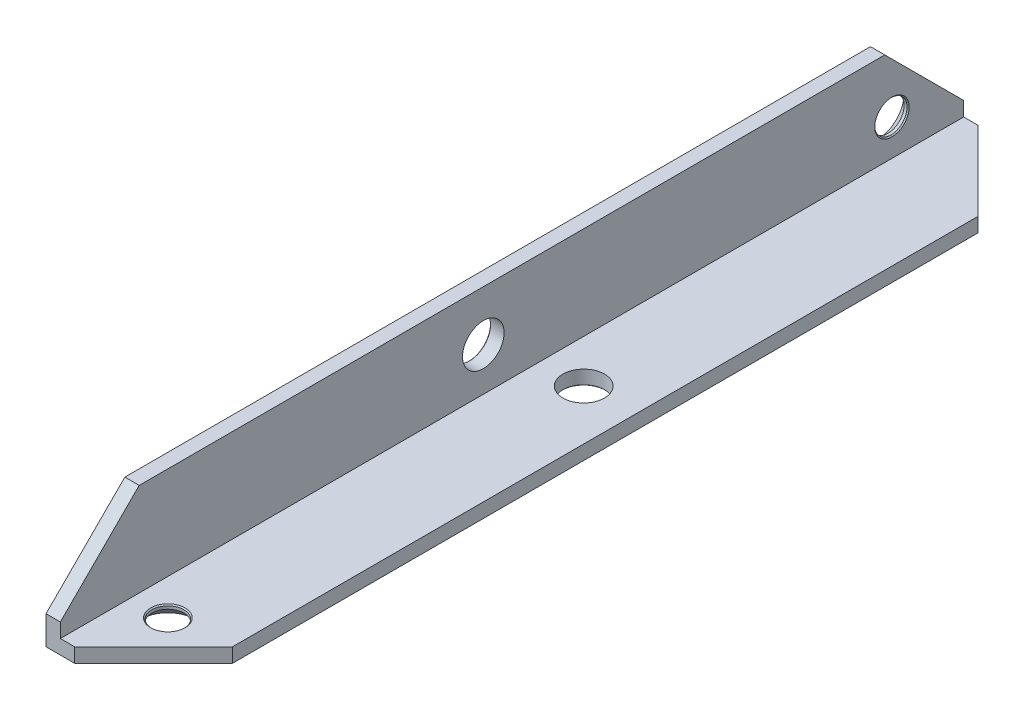
ISO-10303-21;
HEADER;
FILE_DESCRIPTION(('STEP AP214'),'2;1');
FILE_NAME('part.step','',(''),(''),'','','');
FILE_SCHEMA(('AUTOMOTIVE_DESIGN { 1 0 10303 214 1 1 1 1 }'));
ENDSEC;
DATA;
#1=APPLICATION_CONTEXT('core data for automotive mechanical design processes');
#2=APPLICATION_PROTOCOL_DEFINITION('international standard','automotive_design',2000,#1);
#3=PRODUCT_CONTEXT('',#1,'mechanical');
#4=PRODUCT('Part','Part','',(#3));
#5=PRODUCT_RELATED_PRODUCT_CATEGORY('part','',(#4));
#6=PRODUCT_DEFINITION_FORMATION('','',#4);
#7=PRODUCT_DEFINITION_CONTEXT('part definition',#1,'design');
#8=PRODUCT_DEFINITION('design','',#6,#7);
#9=PRODUCT_DEFINITION_SHAPE('','',#8);
#10=(LENGTH_UNIT() NAMED_UNIT(*) SI_UNIT(.MILLI.,.METRE.));
#11=(NAMED_UNIT(*) PLANE_ANGLE_UNIT() SI_UNIT($,.RADIAN.));
#12=(NAMED_UNIT(*) SI_UNIT($,.STERADIAN.) SOLID_ANGLE_UNIT());
#13=UNCERTAINTY_MEASURE_WITH_UNIT(LENGTH_MEASURE(1.E-05),#10,'distance_accuracy_value','');
#14=(GEOMETRIC_REPRESENTATION_CONTEXT(3) GLOBAL_UNCERTAINTY_ASSIGNED_CONTEXT((#13)) GLOBAL_UNIT_ASSIGNED_CONTEXT((#10,
#11,#12)) REPRESENTATION_CONTEXT('',''));
#15=CARTESIAN_POINT('',(0.,0.,0.));
#16=DIRECTION('',(0.,0.,1.));
#17=DIRECTION('',(1.,0.,0.));
#18=AXIS2_PLACEMENT_3D('',#15,#16,#17);
#19=CARTESIAN_POINT('',(15.,0.,126.));
#20=DIRECTION('',(0.,1.,0.));
#21=DIRECTION('',(-1.,0.,0.));
#22=AXIS2_PLACEMENT_3D('',#19,#20,#21);
#23=PLANE('',#22);
#24=CARTESIAN_POINT('',(8.,0.,59.));
#25=DIRECTION('',(0.,-1.,0.));
#26=DIRECTION('',(0.,0.,-1.));
#27=AXIS2_PLACEMENT_3D('',#24,#25,#26);
#28=CIRCLE('',#27,3.);
#29=CARTESIAN_POINT('',(8.,0.,56.));
#30=VERTEX_POINT('',#29);
#31=EDGE_CURVE('E201',#30,#30,#28,.T.);
#32=ORIENTED_EDGE('',*,*,#31,.F.);
#33=EDGE_LOOP('',(#32));
#34=FACE_BOUND('',#33,.T.);
#35=CARTESIAN_POINT('',(7.,0.,116.));
#36=DIRECTION('',(0.,-1.,0.));
#37=DIRECTION('',(0.,0.,-1.));
#38=AXIS2_PLACEMENT_3D('',#35,#36,#37);
#39=CIRCLE('',#38,3.7);
#40=CARTESIAN_POINT('',(7.,0.,112.3));
#41=VERTEX_POINT('',#40);
#42=EDGE_CURVE('E220',#41,#41,#39,.T.);
#43=ORIENTED_EDGE('',*,*,#42,.F.);
#44=EDGE_LOOP('',(#43));
#45=FACE_BOUND('',#44,.T.);
#46=DIRECTION('',(1.,0.,0.));
#47=VECTOR('',#46,1.);
#48=CARTESIAN_POINT('',(15.,0.,0.));
#49=LINE('',#48,#47);
#50=CARTESIAN_POINT('',(0.,0.,0.));
#51=VERTEX_POINT('',#50);
#52=CARTESIAN_POINT('',(3.99999999999996,0.,0.));
#53=VERTEX_POINT('',#52);
#54=EDGE_CURVE('E144',#51,#53,#49,.T.);
#55=ORIENTED_EDGE('',*,*,#54,.T.);
#56=DIRECTION('',(0.707106781186549,0.,0.707106781186546));
#57=VECTOR('',#56,1.);
#58=CARTESIAN_POINT('',(15.,0.,11.));
#59=LINE('',#58,#57);
#60=CARTESIAN_POINT('',(15.,0.,11.));
#61=VERTEX_POINT('',#60);
#62=EDGE_CURVE('E189',#53,#61,#59,.T.);
#63=ORIENTED_EDGE('',*,*,#62,.T.);
#64=DIRECTION('',(0.,0.,-1.));
#65=VECTOR('',#64,1.);
#66=CARTESIAN_POINT('',(15.,0.,126.));
#67=LINE('',#66,#65);
#68=CARTESIAN_POINT('',(15.,0.,115.));
#69=VERTEX_POINT('',#68);
#70=EDGE_CURVE('E161',#69,#61,#67,.T.);
#71=ORIENTED_EDGE('',*,*,#70,.F.);
#72=DIRECTION('',(0.707106781186546,0.,-0.707106781186549));
#73=VECTOR('',#72,1.);
#74=CARTESIAN_POINT('',(4.,0.,126.));
#75=LINE('',#74,#73);
#76=CARTESIAN_POINT('',(4.,0.,126.));
#77=VERTEX_POINT('',#76);
#78=EDGE_CURVE('E48',#69,#77,#75,.F.);
#79=ORIENTED_EDGE('',*,*,#78,.T.);
#80=DIRECTION('',(1.,0.,0.));
#81=VECTOR('',#80,1.);
#82=CARTESIAN_POINT('',(15.,0.,126.));
#83=LINE('',#82,#81);
#84=CARTESIAN_POINT('',(0.,0.,126.));
#85=VERTEX_POINT('',#84);
#86=EDGE_CURVE('E120',#85,#77,#83,.T.);
#87=ORIENTED_EDGE('',*,*,#86,.F.);
#88=DIRECTION('',(0.,0.,-1.));
#89=VECTOR('',#88,1.);
#90=CARTESIAN_POINT('',(0.,0.,126.));
#91=LINE('',#90,#89);
#92=EDGE_CURVE('E140',#85,#51,#91,.T.);
#93=ORIENTED_EDGE('',*,*,#92,.T.);
#94=EDGE_LOOP('',(#55,#63,#71,#79,#87,#93));
#95=FACE_BOUND('',#94,.T.);
#96=ADVANCED_FACE('F31',(#34,#45,#95),#23,.F.);
#97=CARTESIAN_POINT('',(15.,2.,126.));
#98=DIRECTION('',(-1.,0.,0.));
#99=DIRECTION('',(0.,-1.,0.));
#100=AXIS2_PLACEMENT_3D('',#97,#98,#99);
#101=PLANE('',#100);
#102=ORIENTED_EDGE('',*,*,#70,.T.);
#103=DIRECTION('',(0.,1.,0.));
#104=VECTOR('',#103,1.);
#105=CARTESIAN_POINT('',(15.,2.,11.));
#106=LINE('',#105,#104);
#107=CARTESIAN_POINT('',(15.,2.,11.));
#108=VERTEX_POINT('',#107);
#109=EDGE_CURVE('E182',#61,#108,#106,.T.);
#110=ORIENTED_EDGE('',*,*,#109,.T.);
#111=DIRECTION('',(0.,0.,-1.));
#112=VECTOR('',#111,1.);
#113=CARTESIAN_POINT('',(15.,2.,126.));
#114=LINE('',#113,#112);
#115=CARTESIAN_POINT('',(15.,2.,115.));
#116=VERTEX_POINT('',#115);
#117=EDGE_CURVE('E131',#116,#108,#114,.T.);
#118=ORIENTED_EDGE('',*,*,#117,.F.);
#119=DIRECTION('',(0.,-1.,0.));
#120=VECTOR('',#119,1.);
#121=CARTESIAN_POINT('',(15.,2.,115.));
#122=LINE('',#121,#120);
#123=EDGE_CURVE('E180',#116,#69,#122,.T.);
#124=ORIENTED_EDGE('',*,*,#123,.T.);
#125=EDGE_LOOP('',(#102,#110,#118,#124));
#126=FACE_BOUND('',#125,.T.);
#127=ADVANCED_FACE('F232',(#126),#101,.F.);
#128=CARTESIAN_POINT('',(2.,2.,126.));
#129=DIRECTION('',(0.,-1.,0.));
#130=DIRECTION('',(0.,0.,-1.));
#131=AXIS2_PLACEMENT_3D('',#128,#129,#130);
#132=PLANE('',#131);
#133=CARTESIAN_POINT('',(8.,2.,59.));
#134=DIRECTION('',(0.,-1.,0.));
#135=DIRECTION('',(0.,0.,-1.));
#136=AXIS2_PLACEMENT_3D('',#133,#134,#135);
#137=CIRCLE('',#136,2.89999999999999);
#138=CARTESIAN_POINT('',(8.,2.,56.1));
#139=VERTEX_POINT('',#138);
#140=EDGE_CURVE('E191',#139,#139,#137,.T.);
#141=ORIENTED_EDGE('',*,*,#140,.T.);
#142=EDGE_LOOP('',(#141));
#143=FACE_BOUND('',#142,.T.);
#144=CARTESIAN_POINT('',(7.,2.,116.));
#145=DIRECTION('',(0.,-1.,0.));
#146=DIRECTION('',(0.,0.,-1.));
#147=AXIS2_PLACEMENT_3D('',#144,#145,#146);
#148=CIRCLE('',#147,2.4);
#149=CARTESIAN_POINT('',(7.,2.,113.6));
#150=VERTEX_POINT('',#149);
#151=EDGE_CURVE('E217',#150,#150,#148,.T.);
#152=ORIENTED_EDGE('',*,*,#151,.T.);
#153=EDGE_LOOP('',(#152));
#154=FACE_BOUND('',#153,.T.);
#155=ORIENTED_EDGE('',*,*,#117,.T.);
#156=DIRECTION('',(-0.707106781186549,0.,-0.707106781186546));
#157=VECTOR('',#156,1.);
#158=CARTESIAN_POINT('',(15.,2.,11.));
#159=LINE('',#158,#157);
#160=CARTESIAN_POINT('',(3.99999999999996,2.,0.));
#161=VERTEX_POINT('',#160);
#162=EDGE_CURVE('E186',#108,#161,#159,.T.);
#163=ORIENTED_EDGE('',*,*,#162,.T.);
#164=DIRECTION('',(-1.,0.,0.));
#165=VECTOR('',#164,1.);
#166=CARTESIAN_POINT('',(2.,2.,0.));
#167=LINE('',#166,#165);
#168=CARTESIAN_POINT('',(2.,2.,0.));
#169=VERTEX_POINT('',#168);
#170=EDGE_CURVE('E127',#161,#169,#167,.T.);
#171=ORIENTED_EDGE('',*,*,#170,.T.);
#172=DIRECTION('',(0.,0.,-1.));
#173=VECTOR('',#172,1.);
#174=CARTESIAN_POINT('',(2.,2.,126.));
#175=LINE('',#174,#173);
#176=CARTESIAN_POINT('',(2.,2.,126.));
#177=VERTEX_POINT('',#176);
#178=EDGE_CURVE('E123',#177,#169,#175,.T.);
#179=ORIENTED_EDGE('',*,*,#178,.F.);
#180=DIRECTION('',(-1.,0.,0.));
#181=VECTOR('',#180,1.);
#182=CARTESIAN_POINT('',(2.,2.,126.));
#183=LINE('',#182,#181);
#184=CARTESIAN_POINT('',(4.,2.,126.));
#185=VERTEX_POINT('',#184);
#186=EDGE_CURVE('E112',#185,#177,#183,.T.);
#187=ORIENTED_EDGE('',*,*,#186,.F.);
#188=DIRECTION('',(-0.707106781186546,0.,0.707106781186549));
#189=VECTOR('',#188,1.);
#190=CARTESIAN_POINT('',(4.,2.,126.));
#191=LINE('',#190,#189);
#192=EDGE_CURVE('E56',#185,#116,#191,.F.);
#193=ORIENTED_EDGE('',*,*,#192,.T.);
#194=EDGE_LOOP('',(#155,#163,#171,#179,#187,#193));
#195=FACE_BOUND('',#194,.T.);
#196=ADVANCED_FACE('F125',(#143,#154,#195),#132,.F.);
#197=CARTESIAN_POINT('',(2.,15.,126.));
#198=DIRECTION('',(-1.,0.,0.));
#199=DIRECTION('',(0.,-1.,0.));
#200=AXIS2_PLACEMENT_3D('',#197,#198,#199);
#201=PLANE('',#200);
#202=CARTESIAN_POINT('',(2.,8.,67.));
#203=DIRECTION('',(-1.,0.,0.));
#204=DIRECTION('',(0.,-1.,0.));
#205=AXIS2_PLACEMENT_3D('',#202,#203,#204);
#206=CIRCLE('',#205,2.89999999999999);
#207=CARTESIAN_POINT('',(2.,5.10000000000001,67.));
#208=VERTEX_POINT('',#207);
#209=EDGE_CURVE('E35',#208,#208,#206,.T.);
#210=ORIENTED_EDGE('',*,*,#209,.T.);
#211=EDGE_LOOP('',(#210));
#212=FACE_BOUND('',#211,.T.);
#213=CARTESIAN_POINT('',(2.,7.,9.99999999999999));
#214=DIRECTION('',(-1.,0.,0.));
#215=DIRECTION('',(0.,0.,1.));
#216=AXIS2_PLACEMENT_3D('',#213,#214,#215);
#217=CIRCLE('',#216,2.4);
#218=CARTESIAN_POINT('',(2.,7.,12.4));
#219=VERTEX_POINT('',#218);
#220=EDGE_CURVE('E193',#219,#219,#217,.T.);
#221=ORIENTED_EDGE('',*,*,#220,.T.);
#222=EDGE_LOOP('',(#221));
#223=FACE_BOUND('',#222,.T.);
#224=DIRECTION('',(0.,1.,0.));
#225=VECTOR('',#224,1.);
#226=CARTESIAN_POINT('',(2.,15.,0.));
#227=LINE('',#226,#225);
#228=CARTESIAN_POINT('',(2.,3.99999999999996,0.));
#229=VERTEX_POINT('',#228);
#230=EDGE_CURVE('E149',#169,#229,#227,.T.);
#231=ORIENTED_EDGE('',*,*,#230,.T.);
#232=DIRECTION('',(0.,0.707106781186549,0.707106781186546));
#233=VECTOR('',#232,1.);
#234=CARTESIAN_POINT('',(2.,15.,11.));
#235=LINE('',#234,#233);
#236=CARTESIAN_POINT('',(2.,15.,11.));
#237=VERTEX_POINT('',#236);
#238=EDGE_CURVE('E178',#229,#237,#235,.T.);
#239=ORIENTED_EDGE('',*,*,#238,.T.);
#240=DIRECTION('',(0.,0.,-1.));
#241=VECTOR('',#240,1.);
#242=CARTESIAN_POINT('',(2.,15.,126.));
#243=LINE('',#242,#241);
#244=CARTESIAN_POINT('',(2.,15.,115.));
#245=VERTEX_POINT('',#244);
#246=EDGE_CURVE('E132',#245,#237,#243,.T.);
#247=ORIENTED_EDGE('',*,*,#246,.F.);
#248=DIRECTION('',(0.,0.707106781186546,-0.707106781186549));
#249=VECTOR('',#248,1.);
#250=CARTESIAN_POINT('',(2.,4.,126.));
#251=LINE('',#250,#249);
#252=CARTESIAN_POINT('',(2.,4.,126.));
#253=VERTEX_POINT('',#252);
#254=EDGE_CURVE('E137',#245,#253,#251,.F.);
#255=ORIENTED_EDGE('',*,*,#254,.T.);
#256=DIRECTION('',(0.,1.,0.));
#257=VECTOR('',#256,1.);
#258=CARTESIAN_POINT('',(2.,15.,126.));
#259=LINE('',#258,#257);
#260=EDGE_CURVE('E117',#177,#253,#259,.T.);
#261=ORIENTED_EDGE('',*,*,#260,.F.);
#262=ORIENTED_EDGE('',*,*,#178,.T.);
#263=EDGE_LOOP('',(#231,#239,#247,#255,#261,#262));
#264=FACE_BOUND('',#263,.T.);
#265=ADVANCED_FACE('F134',(#212,#223,#264),#201,.F.);
#266=CARTESIAN_POINT('',(0.,15.,126.));
#267=DIRECTION('',(0.,-1.,0.));
#268=DIRECTION('',(1.,0.,0.));
#269=AXIS2_PLACEMENT_3D('',#266,#267,#268);
#270=PLANE('',#269);
#271=ORIENTED_EDGE('',*,*,#246,.T.);
#272=DIRECTION('',(-1.,0.,0.));
#273=VECTOR('',#272,1.);
#274=CARTESIAN_POINT('',(0.,15.,11.));
#275=LINE('',#274,#273);
#276=CARTESIAN_POINT('',(0.,15.,11.));
#277=VERTEX_POINT('',#276);
#278=EDGE_CURVE('E166',#237,#277,#275,.T.);
#279=ORIENTED_EDGE('',*,*,#278,.T.);
#280=DIRECTION('',(0.,0.,-1.));
#281=VECTOR('',#280,1.);
#282=CARTESIAN_POINT('',(0.,15.,126.));
#283=LINE('',#282,#281);
#284=CARTESIAN_POINT('',(0.,15.,115.));
#285=VERTEX_POINT('',#284);
#286=EDGE_CURVE('E155',#285,#277,#283,.T.);
#287=ORIENTED_EDGE('',*,*,#286,.F.);
#288=DIRECTION('',(1.,0.,0.));
#289=VECTOR('',#288,1.);
#290=CARTESIAN_POINT('',(0.,15.,115.));
#291=LINE('',#290,#289);
#292=EDGE_CURVE('E164',#285,#245,#291,.T.);
#293=ORIENTED_EDGE('',*,*,#292,.T.);
#294=EDGE_LOOP('',(#271,#279,#287,#293));
#295=FACE_BOUND('',#294,.T.);
#296=ADVANCED_FACE('F249',(#295),#270,.F.);
#297=CARTESIAN_POINT('',(0.,0.,126.));
#298=DIRECTION('',(1.,0.,0.));
#299=DIRECTION('',(0.,0.,-1.));
#300=AXIS2_PLACEMENT_3D('',#297,#298,#299);
#301=PLANE('',#300);
#302=CARTESIAN_POINT('',(0.,8.,67.));
#303=DIRECTION('',(-1.,0.,0.));
#304=DIRECTION('',(0.,0.,1.));
#305=AXIS2_PLACEMENT_3D('',#302,#303,#304);
#306=CIRCLE('',#305,3.);
#307=CARTESIAN_POINT('',(0.,8.,70.));
#308=VERTEX_POINT('',#307);
#309=EDGE_CURVE('E458',#308,#308,#306,.T.);
#310=ORIENTED_EDGE('',*,*,#309,.F.);
#311=EDGE_LOOP('',(#310));
#312=FACE_BOUND('',#311,.T.);
#313=CARTESIAN_POINT('',(0.,7.,9.99999999999999));
#314=DIRECTION('',(-1.,0.,0.));
#315=DIRECTION('',(0.,0.,1.));
#316=AXIS2_PLACEMENT_3D('',#313,#314,#315);
#317=CIRCLE('',#316,3.7);
#318=CARTESIAN_POINT('',(0.,7.,13.7));
#319=VERTEX_POINT('',#318);
#320=EDGE_CURVE('E198',#319,#319,#317,.T.);
#321=ORIENTED_EDGE('',*,*,#320,.F.);
#322=EDGE_LOOP('',(#321));
#323=FACE_BOUND('',#322,.T.);
#324=ORIENTED_EDGE('',*,*,#286,.T.);
#325=DIRECTION('',(0.,-0.707106781186549,-0.707106781186546));
#326=VECTOR('',#325,1.);
#327=CARTESIAN_POINT('',(0.,15.,11.));
#328=LINE('',#327,#326);
#329=CARTESIAN_POINT('',(0.,3.99999999999996,0.));
#330=VERTEX_POINT('',#329);
#331=EDGE_CURVE('E171',#277,#330,#328,.T.);
#332=ORIENTED_EDGE('',*,*,#331,.T.);
#333=DIRECTION('',(0.,-1.,0.));
#334=VECTOR('',#333,1.);
#335=CARTESIAN_POINT('',(0.,0.,0.));
#336=LINE('',#335,#334);
#337=EDGE_CURVE('E151',#330,#51,#336,.T.);
#338=ORIENTED_EDGE('',*,*,#337,.T.);
#339=ORIENTED_EDGE('',*,*,#92,.F.);
#340=DIRECTION('',(0.,-1.,0.));
#341=VECTOR('',#340,1.);
#342=CARTESIAN_POINT('',(0.,0.,126.));
#343=LINE('',#342,#341);
#344=CARTESIAN_POINT('',(0.,4.,126.));
#345=VERTEX_POINT('',#344);
#346=EDGE_CURVE('E138',#345,#85,#343,.T.);
#347=ORIENTED_EDGE('',*,*,#346,.F.);
#348=DIRECTION('',(0.,-0.707106781186546,0.707106781186549));
#349=VECTOR('',#348,1.);
#350=CARTESIAN_POINT('',(0.,4.,126.));
#351=LINE('',#350,#349);
#352=EDGE_CURVE('E169',#345,#285,#351,.F.);
#353=ORIENTED_EDGE('',*,*,#352,.T.);
#354=EDGE_LOOP('',(#324,#332,#338,#339,#347,#353));
#355=FACE_BOUND('',#354,.T.);
#356=ADVANCED_FACE('F252',(#312,#323,#355),#301,.F.);
#357=CARTESIAN_POINT('',(0.,0.,126.));
#358=DIRECTION('',(0.,0.,-1.));
#359=DIRECTION('',(-1.,0.,0.));
#360=AXIS2_PLACEMENT_3D('',#357,#358,#359);
#361=PLANE('',#360);
#362=ORIENTED_EDGE('',*,*,#86,.T.);
#363=DIRECTION('',(0.,1.,0.));
#364=VECTOR('',#363,1.);
#365=CARTESIAN_POINT('',(4.,0.,126.));
#366=LINE('',#365,#364);
#367=EDGE_CURVE('E11',#77,#185,#366,.T.);
#368=ORIENTED_EDGE('',*,*,#367,.T.);
#369=ORIENTED_EDGE('',*,*,#186,.T.);
#370=ORIENTED_EDGE('',*,*,#260,.T.);
#371=DIRECTION('',(-1.,0.,0.));
#372=VECTOR('',#371,1.);
#373=CARTESIAN_POINT('',(0.,4.,126.));
#374=LINE('',#373,#372);
#375=EDGE_CURVE('E40',#253,#345,#374,.T.);
#376=ORIENTED_EDGE('',*,*,#375,.T.);
#377=ORIENTED_EDGE('',*,*,#346,.T.);
#378=EDGE_LOOP('',(#362,#368,#369,#370,#376,#377));
#379=FACE_BOUND('',#378,.T.);
#380=ADVANCED_FACE('F114',(#379),#361,.F.);
#381=CARTESIAN_POINT('',(0.,0.,0.));
#382=DIRECTION('',(0.,0.,-1.));
#383=DIRECTION('',(-1.,0.,0.));
#384=AXIS2_PLACEMENT_3D('',#381,#382,#383);
#385=PLANE('',#384);
#386=ORIENTED_EDGE('',*,*,#337,.F.);
#387=DIRECTION('',(1.,0.,0.));
#388=VECTOR('',#387,1.);
#389=CARTESIAN_POINT('',(2.00000000000001,3.99999999999996,0.));
#390=LINE('',#389,#388);
#391=EDGE_CURVE('E175',#330,#229,#390,.T.);
#392=ORIENTED_EDGE('',*,*,#391,.T.);
#393=ORIENTED_EDGE('',*,*,#230,.F.);
#394=ORIENTED_EDGE('',*,*,#170,.F.);
#395=DIRECTION('',(0.,-1.,0.));
#396=VECTOR('',#395,1.);
#397=CARTESIAN_POINT('',(3.99999999999996,0.,0.));
#398=LINE('',#397,#396);
#399=EDGE_CURVE('E173',#161,#53,#398,.T.);
#400=ORIENTED_EDGE('',*,*,#399,.T.);
#401=ORIENTED_EDGE('',*,*,#54,.F.);
#402=EDGE_LOOP('',(#386,#392,#393,#394,#400,#401));
#403=FACE_BOUND('',#402,.T.);
#404=ADVANCED_FACE('F241',(#403),#385,.T.);
#405=CARTESIAN_POINT('',(0.,15.,11.));
#406=DIRECTION('',(0.,0.707106781186546,-0.707106781186549));
#407=DIRECTION('',(0.,0.707106781186549,0.707106781186546));
#408=AXIS2_PLACEMENT_3D('',#405,#406,#407);
#409=PLANE('',#408);
#410=ORIENTED_EDGE('',*,*,#238,.F.);
#411=ORIENTED_EDGE('',*,*,#391,.F.);
#412=ORIENTED_EDGE('',*,*,#331,.F.);
#413=ORIENTED_EDGE('',*,*,#278,.F.);
#414=EDGE_LOOP('',(#410,#411,#412,#413));
#415=FACE_BOUND('',#414,.T.);
#416=ADVANCED_FACE('F246',(#415),#409,.T.);
#417=CARTESIAN_POINT('',(15.,2.,11.));
#418=DIRECTION('',(0.707106781186546,0.,-0.707106781186549));
#419=DIRECTION('',(-0.707106781186549,0.,-0.707106781186546));
#420=AXIS2_PLACEMENT_3D('',#417,#418,#419);
#421=PLANE('',#420);
#422=ORIENTED_EDGE('',*,*,#62,.F.);
#423=ORIENTED_EDGE('',*,*,#399,.F.);
#424=ORIENTED_EDGE('',*,*,#162,.F.);
#425=ORIENTED_EDGE('',*,*,#109,.F.);
#426=EDGE_LOOP('',(#422,#423,#424,#425));
#427=FACE_BOUND('',#426,.T.);
#428=ADVANCED_FACE('F238',(#427),#421,.T.);
#429=CARTESIAN_POINT('',(4.,0.,126.));
#430=DIRECTION('',(-0.707106781186549,0.,-0.707106781186546));
#431=DIRECTION('',(-0.707106781186546,0.,0.707106781186549));
#432=AXIS2_PLACEMENT_3D('',#429,#430,#431);
#433=PLANE('',#432);
#434=ORIENTED_EDGE('',*,*,#78,.F.);
#435=ORIENTED_EDGE('',*,*,#123,.F.);
#436=ORIENTED_EDGE('',*,*,#192,.F.);
#437=ORIENTED_EDGE('',*,*,#367,.F.);
#438=EDGE_LOOP('',(#434,#435,#436,#437));
#439=FACE_BOUND('',#438,.T.);
#440=ADVANCED_FACE('F229',(#439),#433,.F.);
#441=CARTESIAN_POINT('',(0.,4.,126.));
#442=DIRECTION('',(0.,-0.707106781186549,-0.707106781186546));
#443=DIRECTION('',(0.,0.707106781186546,-0.707106781186549));
#444=AXIS2_PLACEMENT_3D('',#441,#442,#443);
#445=PLANE('',#444);
#446=ORIENTED_EDGE('',*,*,#254,.F.);
#447=ORIENTED_EDGE('',*,*,#292,.F.);
#448=ORIENTED_EDGE('',*,*,#352,.F.);
#449=ORIENTED_EDGE('',*,*,#375,.F.);
#450=EDGE_LOOP('',(#446,#447,#448,#449));
#451=FACE_BOUND('',#450,.T.);
#452=ADVANCED_FACE('F33',(#451),#445,.F.);
#453=CARTESIAN_POINT('',(7.,1.85,116.));
#454=DIRECTION('',(0.,1.,0.));
#455=DIRECTION('',(0.,0.,1.));
#456=AXIS2_PLACEMENT_3D('',#453,#454,#455);
#457=CONICAL_SURFACE('',#456,2.25,0.785398163397447);
#458=ORIENTED_EDGE('',*,*,#151,.F.);
#459=EDGE_LOOP('',(#458));
#460=FACE_BOUND('',#459,.T.);
#461=CARTESIAN_POINT('',(7.,1.85,116.));
#462=DIRECTION('',(0.,-1.,0.));
#463=DIRECTION('',(0.,0.,-1.));
#464=AXIS2_PLACEMENT_3D('',#461,#462,#463);
#465=CIRCLE('',#464,2.25);
#466=CARTESIAN_POINT('',(7.,1.85,113.75));
#467=VERTEX_POINT('',#466);
#468=EDGE_CURVE('E147',#467,#467,#465,.T.);
#469=ORIENTED_EDGE('',*,*,#468,.T.);
#470=EDGE_LOOP('',(#469));
#471=FACE_BOUND('',#470,.T.);
#472=ADVANCED_FACE('F255',(#460,#471),#457,.F.);
#473=CARTESIAN_POINT('',(7.,0.,116.));
#474=DIRECTION('',(0.,-1.,0.));
#475=DIRECTION('',(0.,0.,-1.));
#476=AXIS2_PLACEMENT_3D('',#473,#474,#475);
#477=CYLINDRICAL_SURFACE('',#476,2.24999999999999);
#478=ORIENTED_EDGE('',*,*,#468,.F.);
#479=EDGE_LOOP('',(#478));
#480=FACE_BOUND('',#479,.T.);
#481=CARTESIAN_POINT('',(7.,1.44999999999999,116.));
#482=DIRECTION('',(0.,-1.,0.));
#483=DIRECTION('',(0.,0.,-1.));
#484=AXIS2_PLACEMENT_3D('',#481,#482,#483);
#485=CIRCLE('',#484,2.24999999999999);
#486=CARTESIAN_POINT('',(7.,1.44999999999999,113.75));
#487=VERTEX_POINT('',#486);
#488=EDGE_CURVE('E223',#487,#487,#485,.T.);
#489=ORIENTED_EDGE('',*,*,#488,.T.);
#490=EDGE_LOOP('',(#489));
#491=FACE_BOUND('',#490,.T.);
#492=ADVANCED_FACE('F260',(#480,#491),#477,.F.);
#493=CARTESIAN_POINT('',(7.,0.,116.));
#494=DIRECTION('',(0.,-1.,0.));
#495=DIRECTION('',(0.,0.,-1.));
#496=AXIS2_PLACEMENT_3D('',#493,#494,#495);
#497=CONICAL_SURFACE('',#496,3.7,0.785398163397455);
#498=ORIENTED_EDGE('',*,*,#488,.F.);
#499=EDGE_LOOP('',(#498));
#500=FACE_BOUND('',#499,.T.);
#501=ORIENTED_EDGE('',*,*,#42,.T.);
#502=EDGE_LOOP('',(#501));
#503=FACE_BOUND('',#502,.T.);
#504=ADVANCED_FACE('F305',(#500,#503),#497,.F.);
#505=CARTESIAN_POINT('',(1.85,7.,9.99999999999999));
#506=DIRECTION('',(1.,0.,0.));
#507=DIRECTION('',(0.,0.,-1.));
#508=AXIS2_PLACEMENT_3D('',#505,#506,#507);
#509=CONICAL_SURFACE('',#508,2.25,0.785398163397448);
#510=ORIENTED_EDGE('',*,*,#220,.F.);
#511=EDGE_LOOP('',(#510));
#512=FACE_BOUND('',#511,.T.);
#513=CARTESIAN_POINT('',(1.85,7.,9.99999999999999));
#514=DIRECTION('',(-1.,0.,0.));
#515=DIRECTION('',(0.,0.,1.));
#516=AXIS2_PLACEMENT_3D('',#513,#514,#515);
#517=CIRCLE('',#516,2.25);
#518=CARTESIAN_POINT('',(1.85,7.,12.25));
#519=VERTEX_POINT('',#518);
#520=EDGE_CURVE('E214',#519,#519,#517,.T.);
#521=ORIENTED_EDGE('',*,*,#520,.T.);
#522=EDGE_LOOP('',(#521));
#523=FACE_BOUND('',#522,.T.);
#524=ADVANCED_FACE('F315',(#512,#523),#509,.F.);
#525=CARTESIAN_POINT('',(0.,7.,9.99999999999999));
#526=DIRECTION('',(-1.,0.,0.));
#527=DIRECTION('',(0.,0.,1.));
#528=AXIS2_PLACEMENT_3D('',#525,#526,#527);
#529=CYLINDRICAL_SURFACE('',#528,2.24999999999999);
#530=ORIENTED_EDGE('',*,*,#520,.F.);
#531=EDGE_LOOP('',(#530));
#532=FACE_BOUND('',#531,.T.);
#533=CARTESIAN_POINT('',(1.44999999999999,7.,9.99999999999999));
#534=DIRECTION('',(-1.,0.,0.));
#535=DIRECTION('',(0.,0.,1.));
#536=AXIS2_PLACEMENT_3D('',#533,#534,#535);
#537=CIRCLE('',#536,2.24999999999999);
#538=CARTESIAN_POINT('',(1.44999999999999,7.,12.25));
#539=VERTEX_POINT('',#538);
#540=EDGE_CURVE('E211',#539,#539,#537,.T.);
#541=ORIENTED_EDGE('',*,*,#540,.T.);
#542=EDGE_LOOP('',(#541));
#543=FACE_BOUND('',#542,.T.);
#544=ADVANCED_FACE('F325',(#532,#543),#529,.F.);
#545=CARTESIAN_POINT('',(0.,7.,9.99999999999999));
#546=DIRECTION('',(-1.,0.,0.));
#547=DIRECTION('',(0.,0.,1.));
#548=AXIS2_PLACEMENT_3D('',#545,#546,#547);
#549=CONICAL_SURFACE('',#548,3.7,0.785398163397455);
#550=ORIENTED_EDGE('',*,*,#540,.F.);
#551=EDGE_LOOP('',(#550));
#552=FACE_BOUND('',#551,.T.);
#553=ORIENTED_EDGE('',*,*,#320,.T.);
#554=EDGE_LOOP('',(#553));
#555=FACE_BOUND('',#554,.T.);
#556=ADVANCED_FACE('F335',(#552,#555),#549,.F.);
#557=CARTESIAN_POINT('',(8.,0.,59.));
#558=DIRECTION('',(0.,-1.,0.));
#559=DIRECTION('',(0.,0.,-1.));
#560=AXIS2_PLACEMENT_3D('',#557,#558,#559);
#561=CYLINDRICAL_SURFACE('',#560,2.89999999999999);
#562=CARTESIAN_POINT('',(8.,0.100000000000003,59.));
#563=DIRECTION('',(0.,-1.,0.));
#564=DIRECTION('',(0.,0.,-1.));
#565=AXIS2_PLACEMENT_3D('',#562,#563,#564);
#566=CIRCLE('',#565,2.89999999999999);
#567=CARTESIAN_POINT('',(8.,0.100000000000003,56.1));
#568=VERTEX_POINT('',#567);
#569=EDGE_CURVE('E194',#568,#568,#566,.T.);
#570=ORIENTED_EDGE('',*,*,#569,.T.);
#571=EDGE_LOOP('',(#570));
#572=FACE_BOUND('',#571,.T.);
#573=ORIENTED_EDGE('',*,*,#140,.F.);
#574=EDGE_LOOP('',(#573));
#575=FACE_BOUND('',#574,.T.);
#576=ADVANCED_FACE('F344',(#572,#575),#561,.F.);
#577=CARTESIAN_POINT('',(8.,0.,59.));
#578=DIRECTION('',(0.,-1.,0.));
#579=DIRECTION('',(0.,0.,-1.));
#580=AXIS2_PLACEMENT_3D('',#577,#578,#579);
#581=CONICAL_SURFACE('',#580,3.,0.785398163397474);
#582=ORIENTED_EDGE('',*,*,#569,.F.);
#583=EDGE_LOOP('',(#582));
#584=FACE_BOUND('',#583,.T.);
#585=ORIENTED_EDGE('',*,*,#31,.T.);
#586=EDGE_LOOP('',(#585));
#587=FACE_BOUND('',#586,.T.);
#588=ADVANCED_FACE('F369',(#584,#587),#581,.F.);
#589=CARTESIAN_POINT('',(0.,8.,67.));
#590=DIRECTION('',(-1.,0.,0.));
#591=DIRECTION('',(0.,0.,1.));
#592=AXIS2_PLACEMENT_3D('',#589,#590,#591);
#593=CYLINDRICAL_SURFACE('',#592,2.89999999999999);
#594=CARTESIAN_POINT('',(0.100000000000003,8.,67.));
#595=DIRECTION('',(-1.,0.,0.));
#596=DIRECTION('',(0.,0.,1.));
#597=AXIS2_PLACEMENT_3D('',#594,#595,#596);
#598=CIRCLE('',#597,2.89999999999999);
#599=CARTESIAN_POINT('',(0.100000000000003,8.,69.9));
#600=VERTEX_POINT('',#599);
#601=EDGE_CURVE('E455',#600,#600,#598,.T.);
#602=ORIENTED_EDGE('',*,*,#601,.T.);
#603=EDGE_LOOP('',(#602));
#604=FACE_BOUND('',#603,.T.);
#605=ORIENTED_EDGE('',*,*,#209,.F.);
#606=EDGE_LOOP('',(#605));
#607=FACE_BOUND('',#606,.T.);
#608=ADVANCED_FACE('F378',(#604,#607),#593,.F.);
#609=CARTESIAN_POINT('',(0.,8.,67.));
#610=DIRECTION('',(-1.,0.,0.));
#611=DIRECTION('',(0.,0.,1.));
#612=AXIS2_PLACEMENT_3D('',#609,#610,#611);
#613=CONICAL_SURFACE('',#612,3.,0.785398163397474);
#614=ORIENTED_EDGE('',*,*,#601,.F.);
#615=EDGE_LOOP('',(#614));
#616=FACE_BOUND('',#615,.T.);
#617=ORIENTED_EDGE('',*,*,#309,.T.);
#618=EDGE_LOOP('',(#617));
#619=FACE_BOUND('',#618,.T.);
#620=ADVANCED_FACE('F408',(#616,#619),#613,.F.);
#621=CLOSED_SHELL('',(#96,#127,#196,#265,#296,#356,#380,#404,#416,#428,#440,#452,#472,#492,#504,
#524,#544,#556,#576,#588,#608,#620));
#622=MANIFOLD_SOLID_BREP('B2',#621);
#623=ADVANCED_BREP_SHAPE_REPRESENTATION('',(#18,#622),#14);
#624=SHAPE_DEFINITION_REPRESENTATION(#9,#623);
ENDSEC;
END-ISO-10303-21;
